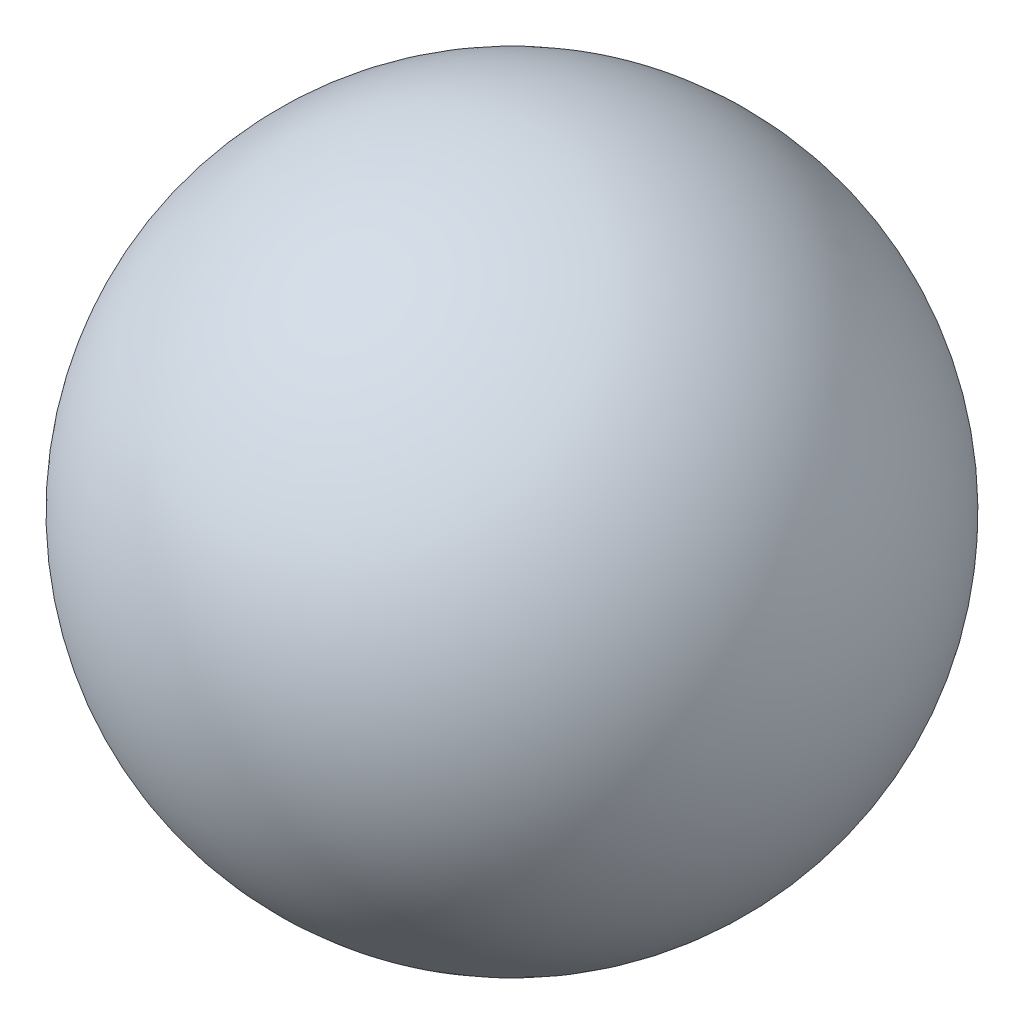
ISO-10303-21;
HEADER;
FILE_DESCRIPTION(('STEP AP214'),'2;1');
FILE_NAME('part.step','',(''),(''),'','','');
FILE_SCHEMA(('AUTOMOTIVE_DESIGN { 1 0 10303 214 1 1 1 1 }'));
ENDSEC;
DATA;
#1=APPLICATION_CONTEXT('core data for automotive mechanical design processes');
#2=APPLICATION_PROTOCOL_DEFINITION('international standard','automotive_design',2000,#1);
#3=PRODUCT_CONTEXT('',#1,'mechanical');
#4=PRODUCT('Part','Part','',(#3));
#5=PRODUCT_RELATED_PRODUCT_CATEGORY('part','',(#4));
#6=PRODUCT_DEFINITION_FORMATION('','',#4);
#7=PRODUCT_DEFINITION_CONTEXT('part definition',#1,'design');
#8=PRODUCT_DEFINITION('design','',#6,#7);
#9=PRODUCT_DEFINITION_SHAPE('','',#8);
#10=(LENGTH_UNIT() NAMED_UNIT(*) SI_UNIT(.MILLI.,.METRE.));
#11=(NAMED_UNIT(*) PLANE_ANGLE_UNIT() SI_UNIT($,.RADIAN.));
#12=(NAMED_UNIT(*) SI_UNIT($,.STERADIAN.) SOLID_ANGLE_UNIT());
#13=UNCERTAINTY_MEASURE_WITH_UNIT(LENGTH_MEASURE(1.E-05),#10,'distance_accuracy_value','');
#14=(GEOMETRIC_REPRESENTATION_CONTEXT(3) GLOBAL_UNCERTAINTY_ASSIGNED_CONTEXT((#13)) GLOBAL_UNIT_ASSIGNED_CONTEXT((#10,
#11,#12)) REPRESENTATION_CONTEXT('',''));
#15=CARTESIAN_POINT('',(0.,0.,0.));
#16=DIRECTION('',(0.,0.,1.));
#17=DIRECTION('',(1.,0.,0.));
#18=AXIS2_PLACEMENT_3D('',#15,#16,#17);
#19=CARTESIAN_POINT('',(64.16,-65.5771608423181,22.6635536679653));
#20=DIRECTION('',(0.,-0.945147382533452,0.326644187595887));
#21=DIRECTION('',(0.173648177666934,-0.321681728420801,-0.930788470058132));
#22=AXIS2_PLACEMENT_3D('',#19,#20,#21);
#23=SPHERICAL_SURFACE('',#22,7.15);
#24=CARTESIAN_POINT('',(64.16,-72.3349646274323,24.999059609276));
#25=VERTEX_POINT('',#24);
#26=VERTEX_LOOP('',#25);
#27=FACE_BOUND('',#26,.T.);
#28=CARTESIAN_POINT('',(64.16,-58.819357057204,20.3280477266547));
#29=VERTEX_POINT('',#28);
#30=VERTEX_LOOP('',#29);
#31=FACE_BOUND('',#30,.T.);
#32=ADVANCED_FACE('F15',(#27,#31),#23,.T.);
#33=CLOSED_SHELL('',(#32));
#34=MANIFOLD_SOLID_BREP('B1',#33);
#35=ADVANCED_BREP_SHAPE_REPRESENTATION('',(#18,#34),#14);
#36=SHAPE_DEFINITION_REPRESENTATION(#9,#35);
ENDSEC;
END-ISO-10303-21;
